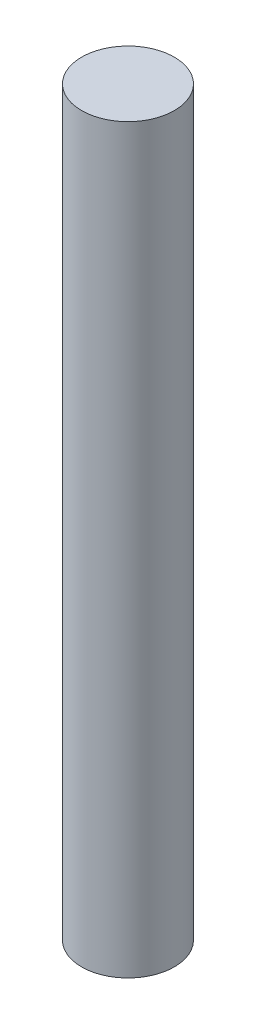
ISO-10303-21;
HEADER;
FILE_DESCRIPTION(('STEP AP214'),'2;1');
FILE_NAME('part.step','',(''),(''),'','','');
FILE_SCHEMA(('AUTOMOTIVE_DESIGN { 1 0 10303 214 1 1 1 1 }'));
ENDSEC;
DATA;
#1=APPLICATION_CONTEXT('core data for automotive mechanical design processes');
#2=APPLICATION_PROTOCOL_DEFINITION('international standard','automotive_design',2000,#1);
#3=PRODUCT_CONTEXT('',#1,'mechanical');
#4=PRODUCT('Part','Part','',(#3));
#5=PRODUCT_RELATED_PRODUCT_CATEGORY('part','',(#4));
#6=PRODUCT_DEFINITION_FORMATION('','',#4);
#7=PRODUCT_DEFINITION_CONTEXT('part definition',#1,'design');
#8=PRODUCT_DEFINITION('design','',#6,#7);
#9=PRODUCT_DEFINITION_SHAPE('','',#8);
#10=(LENGTH_UNIT() NAMED_UNIT(*) SI_UNIT(.MILLI.,.METRE.));
#11=(NAMED_UNIT(*) PLANE_ANGLE_UNIT() SI_UNIT($,.RADIAN.));
#12=(NAMED_UNIT(*) SI_UNIT($,.STERADIAN.) SOLID_ANGLE_UNIT());
#13=UNCERTAINTY_MEASURE_WITH_UNIT(LENGTH_MEASURE(1.E-05),#10,'distance_accuracy_value','');
#14=(GEOMETRIC_REPRESENTATION_CONTEXT(3) GLOBAL_UNCERTAINTY_ASSIGNED_CONTEXT((#13)) GLOBAL_UNIT_ASSIGNED_CONTEXT((#10,
#11,#12)) REPRESENTATION_CONTEXT('',''));
#15=CARTESIAN_POINT('',(0.,0.,0.));
#16=DIRECTION('',(0.,0.,1.));
#17=DIRECTION('',(1.,0.,0.));
#18=AXIS2_PLACEMENT_3D('',#15,#16,#17);
#19=CARTESIAN_POINT('',(0.,40.,0.));
#20=DIRECTION('',(0.,-1.,0.));
#21=DIRECTION('',(0.,0.,-1.));
#22=AXIS2_PLACEMENT_3D('',#19,#20,#21);
#23=CYLINDRICAL_SURFACE('',#22,2.5);
#24=CARTESIAN_POINT('',(0.,40.,0.));
#25=DIRECTION('',(0.,1.,0.));
#26=DIRECTION('',(0.,0.,1.));
#27=AXIS2_PLACEMENT_3D('',#24,#25,#26);
#28=CIRCLE('',#27,2.5);
#29=CARTESIAN_POINT('',(0.,40.,2.5));
#30=VERTEX_POINT('',#29);
#31=EDGE_CURVE('E10',#30,#30,#28,.T.);
#32=ORIENTED_EDGE('',*,*,#31,.F.);
#33=EDGE_LOOP('',(#32));
#34=FACE_BOUND('',#33,.T.);
#35=CARTESIAN_POINT('',(0.,0.,0.));
#36=DIRECTION('',(0.,1.,0.));
#37=DIRECTION('',(0.,0.,1.));
#38=AXIS2_PLACEMENT_3D('',#35,#36,#37);
#39=CIRCLE('',#38,2.5);
#40=CARTESIAN_POINT('',(0.,0.,2.5));
#41=VERTEX_POINT('',#40);
#42=EDGE_CURVE('E42',#41,#41,#39,.T.);
#43=ORIENTED_EDGE('',*,*,#42,.T.);
#44=EDGE_LOOP('',(#43));
#45=FACE_BOUND('',#44,.T.);
#46=ADVANCED_FACE('F39',(#34,#45),#23,.T.);
#47=CARTESIAN_POINT('',(0.,40.,0.));
#48=DIRECTION('',(0.,1.,0.));
#49=DIRECTION('',(0.,0.,1.));
#50=AXIS2_PLACEMENT_3D('',#47,#48,#49);
#51=PLANE('',#50);
#52=ORIENTED_EDGE('',*,*,#31,.T.);
#53=EDGE_LOOP('',(#52));
#54=FACE_BOUND('',#53,.T.);
#55=ADVANCED_FACE('F54',(#54),#51,.T.);
#56=CARTESIAN_POINT('',(0.,0.,0.));
#57=DIRECTION('',(0.,1.,0.));
#58=DIRECTION('',(0.,0.,1.));
#59=AXIS2_PLACEMENT_3D('',#56,#57,#58);
#60=PLANE('',#59);
#61=ORIENTED_EDGE('',*,*,#42,.F.);
#62=EDGE_LOOP('',(#61));
#63=FACE_BOUND('',#62,.T.);
#64=ADVANCED_FACE('F52',(#63),#60,.F.);
#65=CLOSED_SHELL('',(#46,#55,#64));
#66=MANIFOLD_SOLID_BREP('B2',#65);
#67=ADVANCED_BREP_SHAPE_REPRESENTATION('',(#18,#66),#14);
#68=SHAPE_DEFINITION_REPRESENTATION(#9,#67);
ENDSEC;
END-ISO-10303-21;
